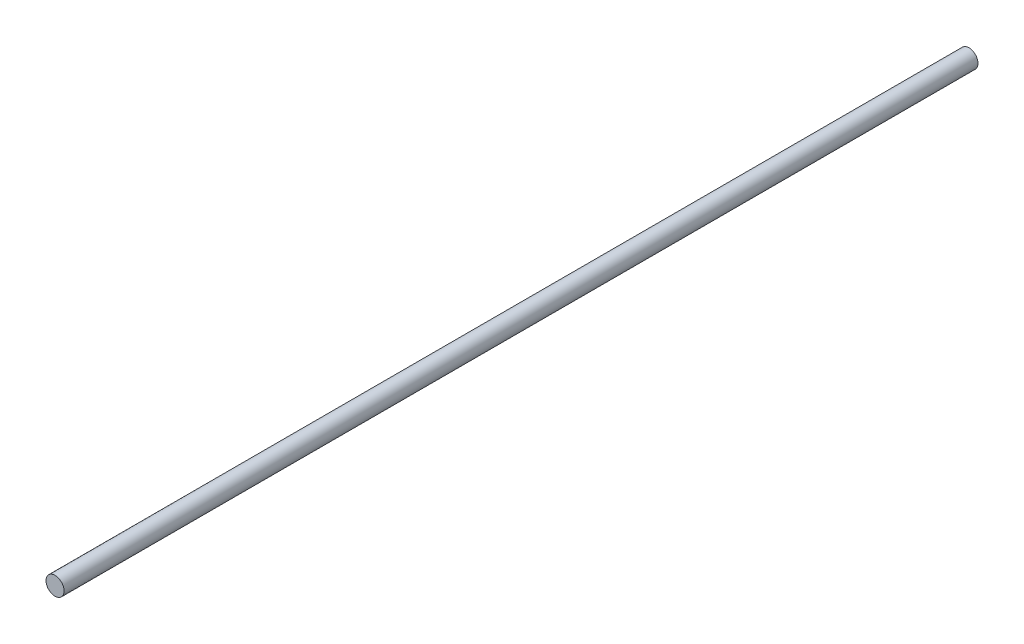
ISO-10303-21;
HEADER;
FILE_DESCRIPTION(('STEP AP214'),'2;1');
FILE_NAME('part.step','',(''),(''),'','','');
FILE_SCHEMA(('AUTOMOTIVE_DESIGN { 1 0 10303 214 1 1 1 1 }'));
ENDSEC;
DATA;
#1=APPLICATION_CONTEXT('core data for automotive mechanical design processes');
#2=APPLICATION_PROTOCOL_DEFINITION('international standard','automotive_design',2000,#1);
#3=PRODUCT_CONTEXT('',#1,'mechanical');
#4=PRODUCT('Part','Part','',(#3));
#5=PRODUCT_RELATED_PRODUCT_CATEGORY('part','',(#4));
#6=PRODUCT_DEFINITION_FORMATION('','',#4);
#7=PRODUCT_DEFINITION_CONTEXT('part definition',#1,'design');
#8=PRODUCT_DEFINITION('design','',#6,#7);
#9=PRODUCT_DEFINITION_SHAPE('','',#8);
#10=(LENGTH_UNIT() NAMED_UNIT(*) SI_UNIT(.MILLI.,.METRE.));
#11=(NAMED_UNIT(*) PLANE_ANGLE_UNIT() SI_UNIT($,.RADIAN.));
#12=(NAMED_UNIT(*) SI_UNIT($,.STERADIAN.) SOLID_ANGLE_UNIT());
#13=UNCERTAINTY_MEASURE_WITH_UNIT(LENGTH_MEASURE(1.E-05),#10,'distance_accuracy_value','');
#14=(GEOMETRIC_REPRESENTATION_CONTEXT(3) GLOBAL_UNCERTAINTY_ASSIGNED_CONTEXT((#13)) GLOBAL_UNIT_ASSIGNED_CONTEXT((#10,
#11,#12)) REPRESENTATION_CONTEXT('',''));
#15=CARTESIAN_POINT('',(0.,0.,0.));
#16=DIRECTION('',(0.,0.,1.));
#17=DIRECTION('',(1.,0.,0.));
#18=AXIS2_PLACEMENT_3D('',#15,#16,#17);
#19=CARTESIAN_POINT('',(0.,0.,201.85));
#20=DIRECTION('',(0.,0.,-1.));
#21=DIRECTION('',(-1.,0.,0.));
#22=AXIS2_PLACEMENT_3D('',#19,#20,#21);
#23=CYLINDRICAL_SURFACE('',#22,2.);
#24=CARTESIAN_POINT('',(0.,0.,201.85));
#25=DIRECTION('',(0.,0.,1.));
#26=DIRECTION('',(1.,0.,0.));
#27=AXIS2_PLACEMENT_3D('',#24,#25,#26);
#28=CIRCLE('',#27,2.);
#29=CARTESIAN_POINT('',(2.,0.,201.85));
#30=VERTEX_POINT('',#29);
#31=EDGE_CURVE('E10',#30,#30,#28,.T.);
#32=ORIENTED_EDGE('',*,*,#31,.F.);
#33=EDGE_LOOP('',(#32));
#34=FACE_BOUND('',#33,.T.);
#35=CARTESIAN_POINT('',(0.,0.,0.));
#36=DIRECTION('',(0.,0.,1.));
#37=DIRECTION('',(1.,0.,0.));
#38=AXIS2_PLACEMENT_3D('',#35,#36,#37);
#39=CIRCLE('',#38,2.);
#40=CARTESIAN_POINT('',(2.,0.,0.));
#41=VERTEX_POINT('',#40);
#42=EDGE_CURVE('E33',#41,#41,#39,.T.);
#43=ORIENTED_EDGE('',*,*,#42,.T.);
#44=EDGE_LOOP('',(#43));
#45=FACE_BOUND('',#44,.T.);
#46=ADVANCED_FACE('F30',(#34,#45),#23,.T.);
#47=CARTESIAN_POINT('',(0.,0.,201.85));
#48=DIRECTION('',(0.,0.,1.));
#49=DIRECTION('',(1.,0.,0.));
#50=AXIS2_PLACEMENT_3D('',#47,#48,#49);
#51=PLANE('',#50);
#52=ORIENTED_EDGE('',*,*,#31,.T.);
#53=EDGE_LOOP('',(#52));
#54=FACE_BOUND('',#53,.T.);
#55=ADVANCED_FACE('F45',(#54),#51,.T.);
#56=CARTESIAN_POINT('',(0.,0.,0.));
#57=DIRECTION('',(0.,0.,1.));
#58=DIRECTION('',(1.,0.,0.));
#59=AXIS2_PLACEMENT_3D('',#56,#57,#58);
#60=PLANE('',#59);
#61=ORIENTED_EDGE('',*,*,#42,.F.);
#62=EDGE_LOOP('',(#61));
#63=FACE_BOUND('',#62,.T.);
#64=ADVANCED_FACE('F43',(#63),#60,.F.);
#65=CLOSED_SHELL('',(#46,#55,#64));
#66=MANIFOLD_SOLID_BREP('B2',#65);
#67=ADVANCED_BREP_SHAPE_REPRESENTATION('',(#18,#66),#14);
#68=SHAPE_DEFINITION_REPRESENTATION(#9,#67);
ENDSEC;
END-ISO-10303-21;
